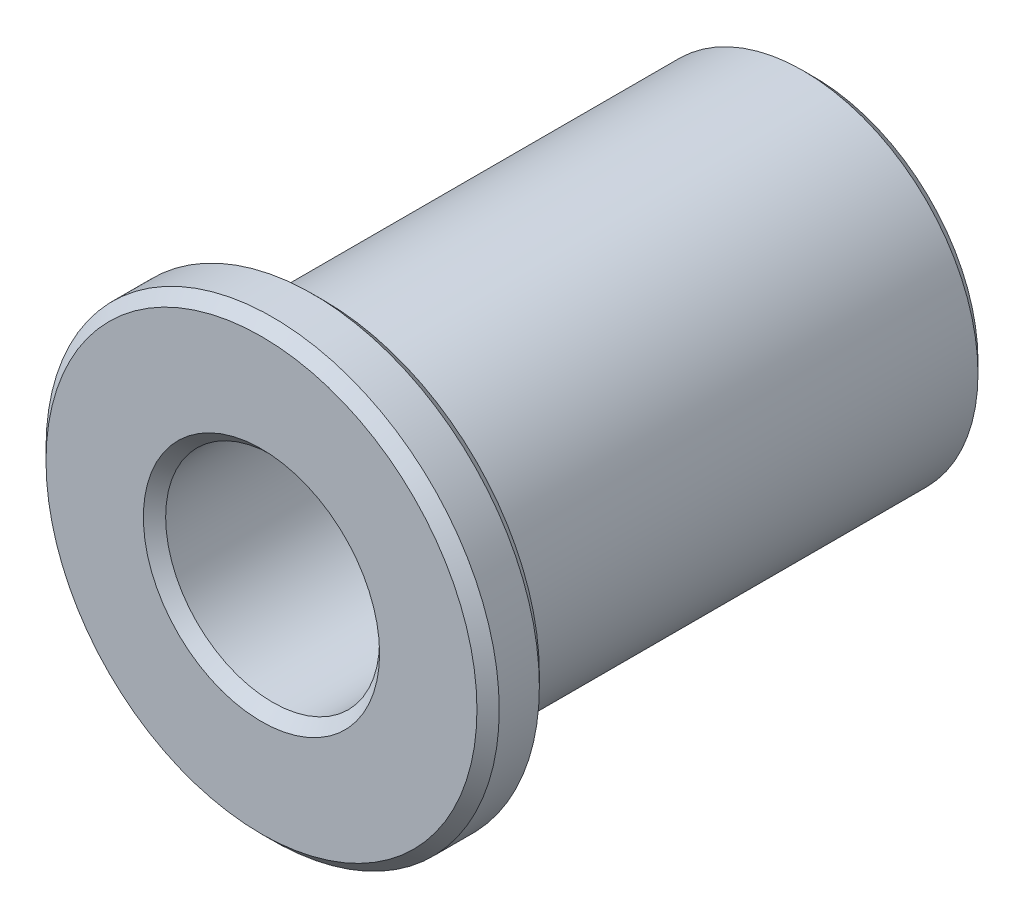
ISO-10303-21;
HEADER;
FILE_DESCRIPTION(('STEP AP214'),'2;1');
FILE_NAME('part.step','',(''),(''),'','','');
FILE_SCHEMA(('AUTOMOTIVE_DESIGN { 1 0 10303 214 1 1 1 1 }'));
ENDSEC;
DATA;
#1=APPLICATION_CONTEXT('core data for automotive mechanical design processes');
#2=APPLICATION_PROTOCOL_DEFINITION('international standard','automotive_design',2000,#1);
#3=PRODUCT_CONTEXT('',#1,'mechanical');
#4=PRODUCT('Part','Part','',(#3));
#5=PRODUCT_RELATED_PRODUCT_CATEGORY('part','',(#4));
#6=PRODUCT_DEFINITION_FORMATION('','',#4);
#7=PRODUCT_DEFINITION_CONTEXT('part definition',#1,'design');
#8=PRODUCT_DEFINITION('design','',#6,#7);
#9=PRODUCT_DEFINITION_SHAPE('','',#8);
#10=(LENGTH_UNIT() NAMED_UNIT(*) SI_UNIT(.MILLI.,.METRE.));
#11=(NAMED_UNIT(*) PLANE_ANGLE_UNIT() SI_UNIT($,.RADIAN.));
#12=(NAMED_UNIT(*) SI_UNIT($,.STERADIAN.) SOLID_ANGLE_UNIT());
#13=UNCERTAINTY_MEASURE_WITH_UNIT(LENGTH_MEASURE(1.E-05),#10,'distance_accuracy_value','');
#14=(GEOMETRIC_REPRESENTATION_CONTEXT(3) GLOBAL_UNCERTAINTY_ASSIGNED_CONTEXT((#13)) GLOBAL_UNIT_ASSIGNED_CONTEXT((#10,
#11,#12)) REPRESENTATION_CONTEXT('',''));
#15=CARTESIAN_POINT('',(0.,0.,0.));
#16=DIRECTION('',(0.,0.,1.));
#17=DIRECTION('',(1.,0.,0.));
#18=AXIS2_PLACEMENT_3D('',#15,#16,#17);
#19=CARTESIAN_POINT('',(0.,0.,-11.));
#20=DIRECTION('',(0.,0.,1.));
#21=DIRECTION('',(1.,0.,0.));
#22=AXIS2_PLACEMENT_3D('',#19,#20,#21);
#23=CYLINDRICAL_SURFACE('',#22,3.925);
#24=CARTESIAN_POINT('',(0.,0.,-10.75));
#25=DIRECTION('',(0.,0.,1.));
#26=DIRECTION('',(1.,0.,0.));
#27=AXIS2_PLACEMENT_3D('',#24,#25,#26);
#28=CIRCLE('',#27,3.925);
#29=CARTESIAN_POINT('',(3.925,0.,-10.75));
#30=VERTEX_POINT('',#29);
#31=EDGE_CURVE('E52',#30,#30,#28,.T.);
#32=ORIENTED_EDGE('',*,*,#31,.T.);
#33=EDGE_LOOP('',(#32));
#34=FACE_BOUND('',#33,.T.);
#35=CARTESIAN_POINT('',(0.,0.,0.));
#36=DIRECTION('',(0.,0.,1.));
#37=DIRECTION('',(1.,0.,0.));
#38=AXIS2_PLACEMENT_3D('',#35,#36,#37);
#39=CIRCLE('',#38,3.925);
#40=CARTESIAN_POINT('',(3.925,0.,0.));
#41=VERTEX_POINT('',#40);
#42=EDGE_CURVE('E70',#41,#41,#39,.T.);
#43=ORIENTED_EDGE('',*,*,#42,.F.);
#44=EDGE_LOOP('',(#43));
#45=FACE_BOUND('',#44,.T.);
#46=ADVANCED_FACE('F32',(#34,#45),#23,.T.);
#47=CARTESIAN_POINT('',(0.,0.,-11.));
#48=DIRECTION('',(0.,0.,1.));
#49=DIRECTION('',(1.,0.,0.));
#50=AXIS2_PLACEMENT_3D('',#47,#48,#49);
#51=PLANE('',#50);
#52=CARTESIAN_POINT('',(0.,0.,-11.));
#53=DIRECTION('',(0.,0.,1.));
#54=DIRECTION('',(1.,0.,0.));
#55=AXIS2_PLACEMENT_3D('',#52,#53,#54);
#56=CIRCLE('',#55,3.67499999999999);
#57=CARTESIAN_POINT('',(3.67499999999999,0.,-11.));
#58=VERTEX_POINT('',#57);
#59=EDGE_CURVE('E43',#58,#58,#56,.F.);
#60=ORIENTED_EDGE('',*,*,#59,.T.);
#61=EDGE_LOOP('',(#60));
#62=FACE_BOUND('',#61,.T.);
#63=CARTESIAN_POINT('',(0.,0.,-11.));
#64=DIRECTION('',(0.,0.,1.));
#65=DIRECTION('',(1.,0.,0.));
#66=AXIS2_PLACEMENT_3D('',#63,#64,#65);
#67=CIRCLE('',#66,2.64999999999999);
#68=CARTESIAN_POINT('',(2.64999999999999,0.,-11.));
#69=VERTEX_POINT('',#68);
#70=EDGE_CURVE('E47',#69,#69,#67,.T.);
#71=ORIENTED_EDGE('',*,*,#70,.T.);
#72=EDGE_LOOP('',(#71));
#73=FACE_BOUND('',#72,.T.);
#74=ADVANCED_FACE('F77',(#62,#73),#51,.F.);
#75=CARTESIAN_POINT('',(0.,0.,1.4));
#76=DIRECTION('',(0.,0.,-1.));
#77=DIRECTION('',(-1.,0.,0.));
#78=AXIS2_PLACEMENT_3D('',#75,#76,#77);
#79=CYLINDRICAL_SURFACE('',#78,5.08414963527469);
#80=CARTESIAN_POINT('',(0.,0.,0.250000000000003));
#81=DIRECTION('',(0.,0.,1.));
#82=DIRECTION('',(1.,0.,0.));
#83=AXIS2_PLACEMENT_3D('',#80,#81,#82);
#84=CIRCLE('',#83,5.08414963527469);
#85=CARTESIAN_POINT('',(5.08414963527469,0.,0.250000000000003));
#86=VERTEX_POINT('',#85);
#87=EDGE_CURVE('E64',#86,#86,#84,.T.);
#88=ORIENTED_EDGE('',*,*,#87,.T.);
#89=EDGE_LOOP('',(#88));
#90=FACE_BOUND('',#89,.T.);
#91=CARTESIAN_POINT('',(0.,0.,1.15));
#92=DIRECTION('',(0.,0.,1.));
#93=DIRECTION('',(1.,0.,0.));
#94=AXIS2_PLACEMENT_3D('',#91,#92,#93);
#95=CIRCLE('',#94,5.08414963527469);
#96=CARTESIAN_POINT('',(5.08414963527469,0.,1.15));
#97=VERTEX_POINT('',#96);
#98=EDGE_CURVE('E67',#97,#97,#95,.F.);
#99=ORIENTED_EDGE('',*,*,#98,.T.);
#100=EDGE_LOOP('',(#99));
#101=FACE_BOUND('',#100,.T.);
#102=ADVANCED_FACE('F83',(#90,#101),#79,.T.);
#103=CARTESIAN_POINT('',(0.,0.,1.4));
#104=DIRECTION('',(0.,0.,1.));
#105=DIRECTION('',(1.,0.,0.));
#106=AXIS2_PLACEMENT_3D('',#103,#104,#105);
#107=PLANE('',#106);
#108=CARTESIAN_POINT('',(0.,0.,1.4));
#109=DIRECTION('',(0.,0.,1.));
#110=DIRECTION('',(1.,0.,0.));
#111=AXIS2_PLACEMENT_3D('',#108,#109,#110);
#112=CIRCLE('',#111,4.83414963527468);
#113=CARTESIAN_POINT('',(4.83414963527468,0.,1.4));
#114=VERTEX_POINT('',#113);
#115=EDGE_CURVE('E55',#114,#114,#112,.T.);
#116=ORIENTED_EDGE('',*,*,#115,.T.);
#117=EDGE_LOOP('',(#116));
#118=FACE_BOUND('',#117,.T.);
#119=CARTESIAN_POINT('',(0.,0.,1.4));
#120=DIRECTION('',(0.,0.,1.));
#121=DIRECTION('',(1.,0.,0.));
#122=AXIS2_PLACEMENT_3D('',#119,#120,#121);
#123=CIRCLE('',#122,2.65000000000001);
#124=CARTESIAN_POINT('',(2.65000000000001,0.,1.4));
#125=VERTEX_POINT('',#124);
#126=EDGE_CURVE('E58',#125,#125,#123,.F.);
#127=ORIENTED_EDGE('',*,*,#126,.T.);
#128=EDGE_LOOP('',(#127));
#129=FACE_BOUND('',#128,.T.);
#130=ADVANCED_FACE('F115',(#118,#129),#107,.T.);
#131=CARTESIAN_POINT('',(0.,0.,0.));
#132=DIRECTION('',(0.,0.,1.));
#133=DIRECTION('',(1.,0.,0.));
#134=AXIS2_PLACEMENT_3D('',#131,#132,#133);
#135=PLANE('',#134);
#136=CARTESIAN_POINT('',(0.,0.,0.));
#137=DIRECTION('',(0.,0.,1.));
#138=DIRECTION('',(1.,0.,0.));
#139=AXIS2_PLACEMENT_3D('',#136,#137,#138);
#140=CIRCLE('',#139,4.83414963527468);
#141=CARTESIAN_POINT('',(4.83414963527468,0.,0.));
#142=VERTEX_POINT('',#141);
#143=EDGE_CURVE('E61',#142,#142,#140,.F.);
#144=ORIENTED_EDGE('',*,*,#143,.T.);
#145=EDGE_LOOP('',(#144));
#146=FACE_BOUND('',#145,.T.);
#147=ORIENTED_EDGE('',*,*,#42,.T.);
#148=EDGE_LOOP('',(#147));
#149=FACE_BOUND('',#148,.T.);
#150=ADVANCED_FACE('F74',(#146,#149),#135,.F.);
#151=CARTESIAN_POINT('',(0.,0.,-11.));
#152=DIRECTION('',(0.,0.,1.));
#153=DIRECTION('',(1.,0.,0.));
#154=AXIS2_PLACEMENT_3D('',#151,#152,#153);
#155=CYLINDRICAL_SURFACE('',#154,2.4);
#156=CARTESIAN_POINT('',(0.,0.,-10.75));
#157=DIRECTION('',(0.,0.,1.));
#158=DIRECTION('',(1.,0.,0.));
#159=AXIS2_PLACEMENT_3D('',#156,#157,#158);
#160=CIRCLE('',#159,2.4);
#161=CARTESIAN_POINT('',(2.4,0.,-10.75));
#162=VERTEX_POINT('',#161);
#163=EDGE_CURVE('E10',#162,#162,#160,.F.);
#164=ORIENTED_EDGE('',*,*,#163,.T.);
#165=EDGE_LOOP('',(#164));
#166=FACE_BOUND('',#165,.T.);
#167=CARTESIAN_POINT('',(0.,0.,1.14999999999999));
#168=DIRECTION('',(0.,0.,1.));
#169=DIRECTION('',(1.,0.,0.));
#170=AXIS2_PLACEMENT_3D('',#167,#168,#169);
#171=CIRCLE('',#170,2.4);
#172=CARTESIAN_POINT('',(2.4,0.,1.14999999999999));
#173=VERTEX_POINT('',#172);
#174=EDGE_CURVE('E39',#173,#173,#171,.T.);
#175=ORIENTED_EDGE('',*,*,#174,.T.);
#176=EDGE_LOOP('',(#175));
#177=FACE_BOUND('',#176,.T.);
#178=ADVANCED_FACE('F92',(#166,#177),#155,.F.);
#179=CARTESIAN_POINT('',(0.,0.,0.250000000000003));
#180=DIRECTION('',(0.,0.,1.));
#181=DIRECTION('',(1.,0.,0.));
#182=AXIS2_PLACEMENT_3D('',#179,#180,#181);
#183=CONICAL_SURFACE('',#182,5.08414963527469,0.785398163397452);
#184=ORIENTED_EDGE('',*,*,#143,.F.);
#185=EDGE_LOOP('',(#184));
#186=FACE_BOUND('',#185,.T.);
#187=ORIENTED_EDGE('',*,*,#87,.F.);
#188=EDGE_LOOP('',(#187));
#189=FACE_BOUND('',#188,.T.);
#190=ADVANCED_FACE('F88',(#186,#189),#183,.T.);
#191=CARTESIAN_POINT('',(0.,0.,1.4));
#192=DIRECTION('',(0.,0.,-1.));
#193=DIRECTION('',(-1.,0.,0.));
#194=AXIS2_PLACEMENT_3D('',#191,#192,#193);
#195=CONICAL_SURFACE('',#194,4.83414963527468,0.785398163397452);
#196=ORIENTED_EDGE('',*,*,#98,.F.);
#197=EDGE_LOOP('',(#196));
#198=FACE_BOUND('',#197,.T.);
#199=ORIENTED_EDGE('',*,*,#115,.F.);
#200=EDGE_LOOP('',(#199));
#201=FACE_BOUND('',#200,.T.);
#202=ADVANCED_FACE('F91',(#198,#201),#195,.T.);
#203=CARTESIAN_POINT('',(0.,0.,-10.75));
#204=DIRECTION('',(0.,0.,1.));
#205=DIRECTION('',(1.,0.,0.));
#206=AXIS2_PLACEMENT_3D('',#203,#204,#205);
#207=CONICAL_SURFACE('',#206,3.925,0.785398163397452);
#208=ORIENTED_EDGE('',*,*,#59,.F.);
#209=EDGE_LOOP('',(#208));
#210=FACE_BOUND('',#209,.T.);
#211=ORIENTED_EDGE('',*,*,#31,.F.);
#212=EDGE_LOOP('',(#211));
#213=FACE_BOUND('',#212,.T.);
#214=ADVANCED_FACE('F96',(#210,#213),#207,.T.);
#215=CARTESIAN_POINT('',(0.,0.,-11.));
#216=DIRECTION('',(0.,0.,-1.));
#217=DIRECTION('',(-1.,0.,0.));
#218=AXIS2_PLACEMENT_3D('',#215,#216,#217);
#219=CONICAL_SURFACE('',#218,2.64999999999999,0.785398163397447);
#220=ORIENTED_EDGE('',*,*,#163,.F.);
#221=EDGE_LOOP('',(#220));
#222=FACE_BOUND('',#221,.T.);
#223=ORIENTED_EDGE('',*,*,#70,.F.);
#224=EDGE_LOOP('',(#223));
#225=FACE_BOUND('',#224,.T.);
#226=ADVANCED_FACE('F99',(#222,#225),#219,.F.);
#227=CARTESIAN_POINT('',(0.,0.,1.14999999999999));
#228=DIRECTION('',(0.,0.,1.));
#229=DIRECTION('',(1.,0.,0.));
#230=AXIS2_PLACEMENT_3D('',#227,#228,#229);
#231=CONICAL_SURFACE('',#230,2.4,0.785398163397453);
#232=ORIENTED_EDGE('',*,*,#126,.F.);
#233=EDGE_LOOP('',(#232));
#234=FACE_BOUND('',#233,.T.);
#235=ORIENTED_EDGE('',*,*,#174,.F.);
#236=EDGE_LOOP('',(#235));
#237=FACE_BOUND('',#236,.T.);
#238=ADVANCED_FACE('F34',(#234,#237),#231,.F.);
#239=CLOSED_SHELL('',(#46,#74,#102,#130,#150,#178,#190,#202,#214,#226,#238));
#240=MANIFOLD_SOLID_BREP('B2',#239);
#241=ADVANCED_BREP_SHAPE_REPRESENTATION('',(#18,#240),#14);
#242=SHAPE_DEFINITION_REPRESENTATION(#9,#241);
ENDSEC;
END-ISO-10303-21;
